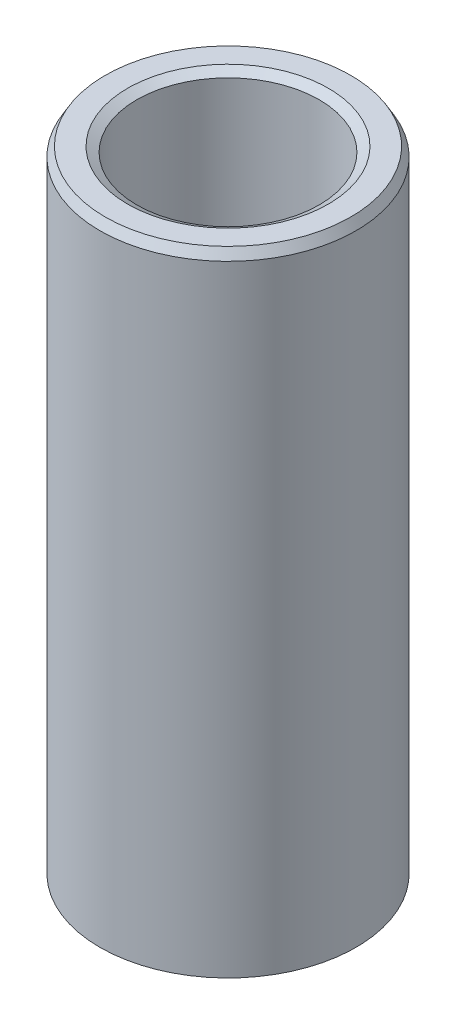
ISO-10303-21;
HEADER;
FILE_DESCRIPTION(('STEP AP214'),'2;1');
FILE_NAME('part.step','',(''),(''),'','','');
FILE_SCHEMA(('AUTOMOTIVE_DESIGN { 1 0 10303 214 1 1 1 1 }'));
ENDSEC;
DATA;
#1=APPLICATION_CONTEXT('core data for automotive mechanical design processes');
#2=APPLICATION_PROTOCOL_DEFINITION('international standard','automotive_design',2000,#1);
#3=PRODUCT_CONTEXT('',#1,'mechanical');
#4=PRODUCT('Part','Part','',(#3));
#5=PRODUCT_RELATED_PRODUCT_CATEGORY('part','',(#4));
#6=PRODUCT_DEFINITION_FORMATION('','',#4);
#7=PRODUCT_DEFINITION_CONTEXT('part definition',#1,'design');
#8=PRODUCT_DEFINITION('design','',#6,#7);
#9=PRODUCT_DEFINITION_SHAPE('','',#8);
#10=(LENGTH_UNIT() NAMED_UNIT(*) SI_UNIT(.MILLI.,.METRE.));
#11=(NAMED_UNIT(*) PLANE_ANGLE_UNIT() SI_UNIT($,.RADIAN.));
#12=(NAMED_UNIT(*) SI_UNIT($,.STERADIAN.) SOLID_ANGLE_UNIT());
#13=UNCERTAINTY_MEASURE_WITH_UNIT(LENGTH_MEASURE(1.E-05),#10,'distance_accuracy_value','');
#14=(GEOMETRIC_REPRESENTATION_CONTEXT(3) GLOBAL_UNCERTAINTY_ASSIGNED_CONTEXT((#13)) GLOBAL_UNIT_ASSIGNED_CONTEXT((#10,
#11,#12)) REPRESENTATION_CONTEXT('',''));
#15=CARTESIAN_POINT('',(0.,0.,0.));
#16=DIRECTION('',(0.,0.,1.));
#17=DIRECTION('',(1.,0.,0.));
#18=AXIS2_PLACEMENT_3D('',#15,#16,#17);
#19=CARTESIAN_POINT('',(0.,74.385829730398,0.));
#20=DIRECTION('',(0.,-1.,0.));
#21=DIRECTION('',(0.,0.,-1.));
#22=AXIS2_PLACEMENT_3D('',#19,#20,#21);
#23=CYLINDRICAL_SURFACE('',#22,15.);
#24=CARTESIAN_POINT('',(0.,0.622582840123301,0.));
#25=DIRECTION('',(0.,1.,0.));
#26=DIRECTION('',(0.,0.,1.));
#27=AXIS2_PLACEMENT_3D('',#24,#25,#26);
#28=CIRCLE('',#27,15.);
#29=CARTESIAN_POINT('',(0.,0.622582840123301,15.));
#30=VERTEX_POINT('',#29);
#31=EDGE_CURVE('E10',#30,#30,#28,.T.);
#32=ORIENTED_EDGE('',*,*,#31,.T.);
#33=EDGE_LOOP('',(#32));
#34=FACE_BOUND('',#33,.T.);
#35=CARTESIAN_POINT('',(0.,73.3074846193839,0.));
#36=DIRECTION('',(0.,1.,0.));
#37=DIRECTION('',(0.,0.,1.));
#38=AXIS2_PLACEMENT_3D('',#35,#36,#37);
#39=CIRCLE('',#38,15.);
#40=CARTESIAN_POINT('',(0.,73.3074846193839,15.));
#41=VERTEX_POINT('',#40);
#42=EDGE_CURVE('E50',#41,#41,#39,.F.);
#43=ORIENTED_EDGE('',*,*,#42,.T.);
#44=EDGE_LOOP('',(#43));
#45=FACE_BOUND('',#44,.T.);
#46=ADVANCED_FACE('F39',(#34,#45),#23,.T.);
#47=CARTESIAN_POINT('',(0.,74.385829730398,0.));
#48=DIRECTION('',(0.,1.,0.));
#49=DIRECTION('',(0.,0.,1.));
#50=AXIS2_PLACEMENT_3D('',#47,#48,#49);
#51=PLANE('',#50);
#52=CARTESIAN_POINT('',(0.,74.385829730398,0.));
#53=DIRECTION('',(0.,1.,0.));
#54=DIRECTION('',(0.,0.,1.));
#55=AXIS2_PLACEMENT_3D('',#52,#53,#54);
#56=CIRCLE('',#55,11.7587557949928);
#57=CARTESIAN_POINT('',(0.,74.385829730398,11.7587557949928));
#58=VERTEX_POINT('',#57);
#59=EDGE_CURVE('E58',#58,#58,#56,.F.);
#60=ORIENTED_EDGE('',*,*,#59,.T.);
#61=EDGE_LOOP('',(#60));
#62=FACE_BOUND('',#61,.T.);
#63=CARTESIAN_POINT('',(0.,74.385829730398,0.));
#64=DIRECTION('',(0.,1.,0.));
#65=DIRECTION('',(0.,0.,1.));
#66=AXIS2_PLACEMENT_3D('',#63,#64,#65);
#67=CIRCLE('',#66,14.3774171598767);
#68=CARTESIAN_POINT('',(0.,74.385829730398,14.3774171598767));
#69=VERTEX_POINT('',#68);
#70=EDGE_CURVE('E61',#69,#69,#67,.T.);
#71=ORIENTED_EDGE('',*,*,#70,.T.);
#72=EDGE_LOOP('',(#71));
#73=FACE_BOUND('',#72,.T.);
#74=ADVANCED_FACE('F88',(#62,#73),#51,.T.);
#75=CARTESIAN_POINT('',(0.,0.,0.));
#76=DIRECTION('',(0.,1.,0.));
#77=DIRECTION('',(0.,0.,1.));
#78=AXIS2_PLACEMENT_3D('',#75,#76,#77);
#79=PLANE('',#78);
#80=CARTESIAN_POINT('',(0.,0.,0.));
#81=DIRECTION('',(0.,1.,0.));
#82=DIRECTION('',(0.,0.,1.));
#83=AXIS2_PLACEMENT_3D('',#80,#81,#82);
#84=CIRCLE('',#83,11.302993524102);
#85=CARTESIAN_POINT('',(0.,0.,11.302993524102));
#86=VERTEX_POINT('',#85);
#87=EDGE_CURVE('E51',#86,#86,#84,.T.);
#88=ORIENTED_EDGE('',*,*,#87,.T.);
#89=EDGE_LOOP('',(#88));
#90=FACE_BOUND('',#89,.T.);
#91=CARTESIAN_POINT('',(0.,0.,0.));
#92=DIRECTION('',(0.,1.,0.));
#93=DIRECTION('',(0.,0.,1.));
#94=AXIS2_PLACEMENT_3D('',#91,#92,#93);
#95=CIRCLE('',#94,13.9216548889859);
#96=CARTESIAN_POINT('',(0.,0.,13.9216548889859));
#97=VERTEX_POINT('',#96);
#98=EDGE_CURVE('E54',#97,#97,#95,.F.);
#99=ORIENTED_EDGE('',*,*,#98,.T.);
#100=EDGE_LOOP('',(#99));
#101=FACE_BOUND('',#100,.T.);
#102=ADVANCED_FACE('F83',(#90,#101),#79,.F.);
#103=CARTESIAN_POINT('',(0.,74.385829730398,0.));
#104=DIRECTION('',(0.,-1.,0.));
#105=DIRECTION('',(0.,0.,-1.));
#106=AXIS2_PLACEMENT_3D('',#103,#104,#105);
#107=CYLINDRICAL_SURFACE('',#106,10.6804106839787);
#108=CARTESIAN_POINT('',(0.,73.7632468902747,0.));
#109=DIRECTION('',(0.,1.,0.));
#110=DIRECTION('',(0.,0.,1.));
#111=AXIS2_PLACEMENT_3D('',#108,#109,#110);
#112=CIRCLE('',#111,10.6804106839787);
#113=CARTESIAN_POINT('',(0.,73.7632468902747,10.6804106839787));
#114=VERTEX_POINT('',#113);
#115=EDGE_CURVE('E67',#114,#114,#112,.T.);
#116=ORIENTED_EDGE('',*,*,#115,.T.);
#117=EDGE_LOOP('',(#116));
#118=FACE_BOUND('',#117,.T.);
#119=CARTESIAN_POINT('',(0.,1.07834511101411,0.));
#120=DIRECTION('',(0.,1.,0.));
#121=DIRECTION('',(0.,0.,1.));
#122=AXIS2_PLACEMENT_3D('',#119,#120,#121);
#123=CIRCLE('',#122,10.6804106839787);
#124=CARTESIAN_POINT('',(0.,1.07834511101411,10.6804106839787));
#125=VERTEX_POINT('',#124);
#126=EDGE_CURVE('E69',#125,#125,#123,.F.);
#127=ORIENTED_EDGE('',*,*,#126,.T.);
#128=EDGE_LOOP('',(#127));
#129=FACE_BOUND('',#128,.T.);
#130=ADVANCED_FACE('F71',(#118,#129),#107,.F.);
#131=CARTESIAN_POINT('',(0.,73.7632468902747,0.));
#132=DIRECTION('',(0.,1.,0.));
#133=DIRECTION('',(0.,0.,1.));
#134=AXIS2_PLACEMENT_3D('',#131,#132,#133);
#135=CONICAL_SURFACE('',#134,10.6804106839787,1.0471975511966);
#136=ORIENTED_EDGE('',*,*,#59,.F.);
#137=EDGE_LOOP('',(#136));
#138=FACE_BOUND('',#137,.T.);
#139=ORIENTED_EDGE('',*,*,#115,.F.);
#140=EDGE_LOOP('',(#139));
#141=FACE_BOUND('',#140,.T.);
#142=ADVANCED_FACE('F77',(#138,#141),#135,.F.);
#143=CARTESIAN_POINT('',(0.,0.,0.));
#144=DIRECTION('',(0.,-1.,0.));
#145=DIRECTION('',(0.,0.,-1.));
#146=AXIS2_PLACEMENT_3D('',#143,#144,#145);
#147=CONICAL_SURFACE('',#146,11.302993524102,0.523598775598295);
#148=ORIENTED_EDGE('',*,*,#126,.F.);
#149=EDGE_LOOP('',(#148));
#150=FACE_BOUND('',#149,.T.);
#151=ORIENTED_EDGE('',*,*,#87,.F.);
#152=EDGE_LOOP('',(#151));
#153=FACE_BOUND('',#152,.T.);
#154=ADVANCED_FACE('F73',(#150,#153),#147,.F.);
#155=CARTESIAN_POINT('',(0.,0.622582840123301,0.));
#156=DIRECTION('',(0.,1.,0.));
#157=DIRECTION('',(0.,0.,1.));
#158=AXIS2_PLACEMENT_3D('',#155,#156,#157);
#159=CONICAL_SURFACE('',#158,15.,1.04719755119661);
#160=ORIENTED_EDGE('',*,*,#98,.F.);
#161=EDGE_LOOP('',(#160));
#162=FACE_BOUND('',#161,.T.);
#163=ORIENTED_EDGE('',*,*,#31,.F.);
#164=EDGE_LOOP('',(#163));
#165=FACE_BOUND('',#164,.T.);
#166=ADVANCED_FACE('F76',(#162,#165),#159,.T.);
#167=CARTESIAN_POINT('',(0.,74.385829730398,0.));
#168=DIRECTION('',(0.,-1.,0.));
#169=DIRECTION('',(0.,0.,-1.));
#170=AXIS2_PLACEMENT_3D('',#167,#168,#169);
#171=CONICAL_SURFACE('',#170,14.3774171598767,0.523598775598299);
#172=ORIENTED_EDGE('',*,*,#42,.F.);
#173=EDGE_LOOP('',(#172));
#174=FACE_BOUND('',#173,.T.);
#175=ORIENTED_EDGE('',*,*,#70,.F.);
#176=EDGE_LOOP('',(#175));
#177=FACE_BOUND('',#176,.T.);
#178=ADVANCED_FACE('F45',(#174,#177),#171,.T.);
#179=CLOSED_SHELL('',(#46,#74,#102,#130,#142,#154,#166,#178));
#180=MANIFOLD_SOLID_BREP('B2',#179);
#181=ADVANCED_BREP_SHAPE_REPRESENTATION('',(#18,#180),#14);
#182=SHAPE_DEFINITION_REPRESENTATION(#9,#181);
ENDSEC;
END-ISO-10303-21;
